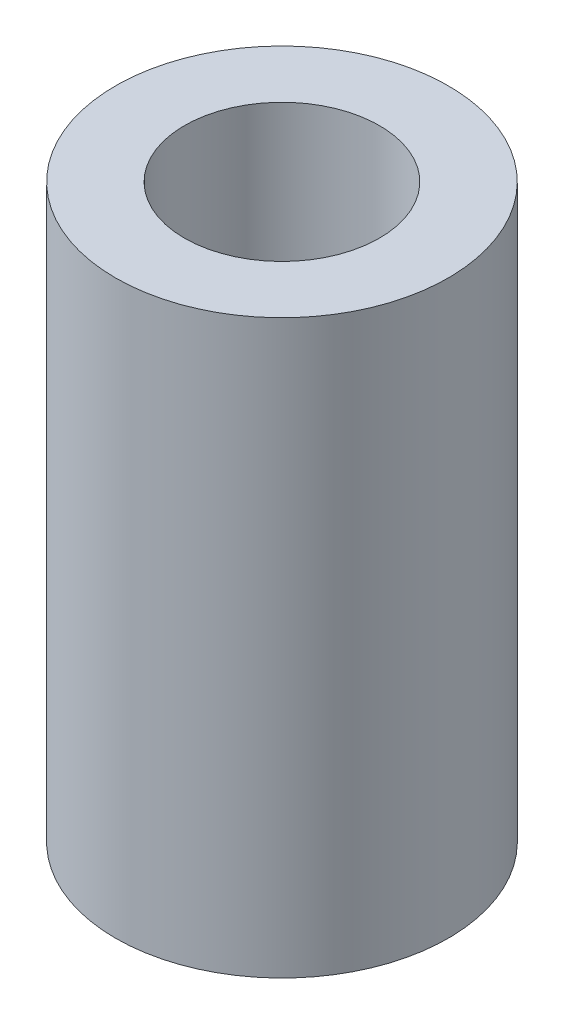
ISO-10303-21;
HEADER;
FILE_DESCRIPTION(('STEP AP214'),'2;1');
FILE_NAME('part.step','',(''),(''),'','','');
FILE_SCHEMA(('AUTOMOTIVE_DESIGN { 1 0 10303 214 1 1 1 1 }'));
ENDSEC;
DATA;
#1=APPLICATION_CONTEXT('core data for automotive mechanical design processes');
#2=APPLICATION_PROTOCOL_DEFINITION('international standard','automotive_design',2000,#1);
#3=PRODUCT_CONTEXT('',#1,'mechanical');
#4=PRODUCT('Part','Part','',(#3));
#5=PRODUCT_RELATED_PRODUCT_CATEGORY('part','',(#4));
#6=PRODUCT_DEFINITION_FORMATION('','',#4);
#7=PRODUCT_DEFINITION_CONTEXT('part definition',#1,'design');
#8=PRODUCT_DEFINITION('design','',#6,#7);
#9=PRODUCT_DEFINITION_SHAPE('','',#8);
#10=(LENGTH_UNIT() NAMED_UNIT(*) SI_UNIT(.MILLI.,.METRE.));
#11=(NAMED_UNIT(*) PLANE_ANGLE_UNIT() SI_UNIT($,.RADIAN.));
#12=(NAMED_UNIT(*) SI_UNIT($,.STERADIAN.) SOLID_ANGLE_UNIT());
#13=UNCERTAINTY_MEASURE_WITH_UNIT(LENGTH_MEASURE(1.E-05),#10,'distance_accuracy_value','');
#14=(GEOMETRIC_REPRESENTATION_CONTEXT(3) GLOBAL_UNCERTAINTY_ASSIGNED_CONTEXT((#13)) GLOBAL_UNIT_ASSIGNED_CONTEXT((#10,
#11,#12)) REPRESENTATION_CONTEXT('',''));
#15=CARTESIAN_POINT('',(0.,0.,0.));
#16=DIRECTION('',(0.,0.,1.));
#17=DIRECTION('',(1.,0.,0.));
#18=AXIS2_PLACEMENT_3D('',#15,#16,#17);
#19=CARTESIAN_POINT('',(0.,34.3646468525003,0.));
#20=DIRECTION('',(0.,-1.,0.));
#21=DIRECTION('',(0.,0.,-1.));
#22=AXIS2_PLACEMENT_3D('',#19,#20,#21);
#23=CYLINDRICAL_SURFACE('',#22,10.);
#24=CARTESIAN_POINT('',(0.,34.3646468525003,0.));
#25=DIRECTION('',(0.,1.,0.));
#26=DIRECTION('',(0.,0.,1.));
#27=AXIS2_PLACEMENT_3D('',#24,#25,#26);
#28=CIRCLE('',#27,10.);
#29=CARTESIAN_POINT('',(0.,34.3646468525003,10.));
#30=VERTEX_POINT('',#29);
#31=EDGE_CURVE('E10',#30,#30,#28,.T.);
#32=ORIENTED_EDGE('',*,*,#31,.F.);
#33=EDGE_LOOP('',(#32));
#34=FACE_BOUND('',#33,.T.);
#35=CARTESIAN_POINT('',(0.,0.,0.));
#36=DIRECTION('',(0.,1.,0.));
#37=DIRECTION('',(0.,0.,1.));
#38=AXIS2_PLACEMENT_3D('',#35,#36,#37);
#39=CIRCLE('',#38,10.);
#40=CARTESIAN_POINT('',(0.,0.,10.));
#41=VERTEX_POINT('',#40);
#42=EDGE_CURVE('E37',#41,#41,#39,.T.);
#43=ORIENTED_EDGE('',*,*,#42,.T.);
#44=EDGE_LOOP('',(#43));
#45=FACE_BOUND('',#44,.T.);
#46=ADVANCED_FACE('F40',(#34,#45),#23,.T.);
#47=CARTESIAN_POINT('',(0.,34.3646468525003,0.));
#48=DIRECTION('',(0.,1.,0.));
#49=DIRECTION('',(0.,0.,1.));
#50=AXIS2_PLACEMENT_3D('',#47,#48,#49);
#51=PLANE('',#50);
#52=CARTESIAN_POINT('',(0.,34.3646468525003,0.));
#53=DIRECTION('',(0.,1.,0.));
#54=DIRECTION('',(0.,0.,1.));
#55=AXIS2_PLACEMENT_3D('',#52,#53,#54);
#56=CIRCLE('',#55,5.86045981496837);
#57=CARTESIAN_POINT('',(0.,34.3646468525003,5.86045981496837));
#58=VERTEX_POINT('',#57);
#59=EDGE_CURVE('E50',#58,#58,#56,.T.);
#60=ORIENTED_EDGE('',*,*,#59,.F.);
#61=EDGE_LOOP('',(#60));
#62=FACE_BOUND('',#61,.T.);
#63=ORIENTED_EDGE('',*,*,#31,.T.);
#64=EDGE_LOOP('',(#63));
#65=FACE_BOUND('',#64,.T.);
#66=ADVANCED_FACE('F59',(#62,#65),#51,.T.);
#67=CARTESIAN_POINT('',(0.,0.,0.));
#68=DIRECTION('',(0.,1.,0.));
#69=DIRECTION('',(0.,0.,1.));
#70=AXIS2_PLACEMENT_3D('',#67,#68,#69);
#71=PLANE('',#70);
#72=CARTESIAN_POINT('',(0.,0.,0.));
#73=DIRECTION('',(0.,1.,0.));
#74=DIRECTION('',(0.,0.,1.));
#75=AXIS2_PLACEMENT_3D('',#72,#73,#74);
#76=CIRCLE('',#75,5.86045981496837);
#77=CARTESIAN_POINT('',(0.,0.,5.86045981496837));
#78=VERTEX_POINT('',#77);
#79=EDGE_CURVE('E47',#78,#78,#76,.T.);
#80=ORIENTED_EDGE('',*,*,#79,.T.);
#81=EDGE_LOOP('',(#80));
#82=FACE_BOUND('',#81,.T.);
#83=ORIENTED_EDGE('',*,*,#42,.F.);
#84=EDGE_LOOP('',(#83));
#85=FACE_BOUND('',#84,.T.);
#86=ADVANCED_FACE('F58',(#82,#85),#71,.F.);
#87=CARTESIAN_POINT('',(0.,34.3646468525003,0.));
#88=DIRECTION('',(0.,-1.,0.));
#89=DIRECTION('',(0.,0.,-1.));
#90=AXIS2_PLACEMENT_3D('',#87,#88,#89);
#91=CYLINDRICAL_SURFACE('',#90,5.86045981496837);
#92=ORIENTED_EDGE('',*,*,#59,.T.);
#93=EDGE_LOOP('',(#92));
#94=FACE_BOUND('',#93,.T.);
#95=ORIENTED_EDGE('',*,*,#79,.F.);
#96=EDGE_LOOP('',(#95));
#97=FACE_BOUND('',#96,.T.);
#98=ADVANCED_FACE('F54',(#94,#97),#91,.F.);
#99=CLOSED_SHELL('',(#46,#66,#86,#98));
#100=MANIFOLD_SOLID_BREP('B2',#99);
#101=ADVANCED_BREP_SHAPE_REPRESENTATION('',(#18,#100),#14);
#102=SHAPE_DEFINITION_REPRESENTATION(#9,#101);
ENDSEC;
END-ISO-10303-21;
